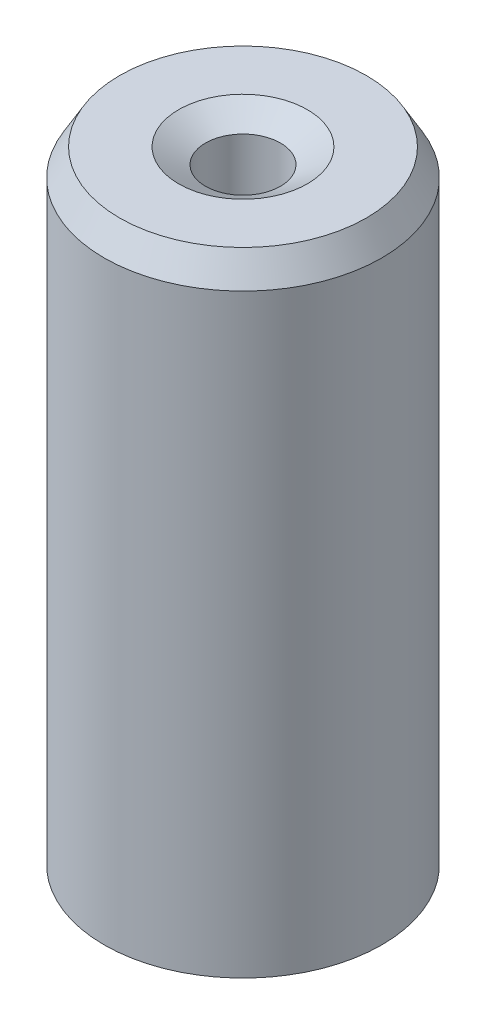
ISO-10303-21;
HEADER;
FILE_DESCRIPTION(('STEP AP214'),'2;1');
FILE_NAME('part.step','',(''),(''),'','','');
FILE_SCHEMA(('AUTOMOTIVE_DESIGN { 1 0 10303 214 1 1 1 1 }'));
ENDSEC;
DATA;
#1=APPLICATION_CONTEXT('core data for automotive mechanical design processes');
#2=APPLICATION_PROTOCOL_DEFINITION('international standard','automotive_design',2000,#1);
#3=PRODUCT_CONTEXT('',#1,'mechanical');
#4=PRODUCT('Part','Part','',(#3));
#5=PRODUCT_RELATED_PRODUCT_CATEGORY('part','',(#4));
#6=PRODUCT_DEFINITION_FORMATION('','',#4);
#7=PRODUCT_DEFINITION_CONTEXT('part definition',#1,'design');
#8=PRODUCT_DEFINITION('design','',#6,#7);
#9=PRODUCT_DEFINITION_SHAPE('','',#8);
#10=(LENGTH_UNIT() NAMED_UNIT(*) SI_UNIT(.MILLI.,.METRE.));
#11=(NAMED_UNIT(*) PLANE_ANGLE_UNIT() SI_UNIT($,.RADIAN.));
#12=(NAMED_UNIT(*) SI_UNIT($,.STERADIAN.) SOLID_ANGLE_UNIT());
#13=UNCERTAINTY_MEASURE_WITH_UNIT(LENGTH_MEASURE(1.E-05),#10,'distance_accuracy_value','');
#14=(GEOMETRIC_REPRESENTATION_CONTEXT(3) GLOBAL_UNCERTAINTY_ASSIGNED_CONTEXT((#13)) GLOBAL_UNIT_ASSIGNED_CONTEXT((#10,
#11,#12)) REPRESENTATION_CONTEXT('',''));
#15=CARTESIAN_POINT('',(0.,0.,0.));
#16=DIRECTION('',(0.,0.,1.));
#17=DIRECTION('',(1.,0.,0.));
#18=AXIS2_PLACEMENT_3D('',#15,#16,#17);
#19=CARTESIAN_POINT('',(0.,22.9424831947394,0.));
#20=DIRECTION('',(0.,-1.,0.));
#21=DIRECTION('',(0.,0.,-1.));
#22=AXIS2_PLACEMENT_3D('',#19,#20,#21);
#23=CYLINDRICAL_SURFACE('',#22,5.);
#24=CARTESIAN_POINT('',(0.,0.557772015662986,0.));
#25=DIRECTION('',(0.,1.,0.));
#26=DIRECTION('',(0.,0.,1.));
#27=AXIS2_PLACEMENT_3D('',#24,#25,#26);
#28=CIRCLE('',#27,5.);
#29=CARTESIAN_POINT('',(0.,0.557772015662986,5.));
#30=VERTEX_POINT('',#29);
#31=EDGE_CURVE('E10',#30,#30,#28,.T.);
#32=ORIENTED_EDGE('',*,*,#31,.T.);
#33=EDGE_LOOP('',(#32));
#34=FACE_BOUND('',#33,.T.);
#35=CARTESIAN_POINT('',(0.,21.976393724571,0.));
#36=DIRECTION('',(0.,1.,0.));
#37=DIRECTION('',(0.,0.,1.));
#38=AXIS2_PLACEMENT_3D('',#35,#36,#37);
#39=CIRCLE('',#38,5.);
#40=CARTESIAN_POINT('',(0.,21.976393724571,5.));
#41=VERTEX_POINT('',#40);
#42=EDGE_CURVE('E50',#41,#41,#39,.F.);
#43=ORIENTED_EDGE('',*,*,#42,.T.);
#44=EDGE_LOOP('',(#43));
#45=FACE_BOUND('',#44,.T.);
#46=ADVANCED_FACE('F39',(#34,#45),#23,.T.);
#47=CARTESIAN_POINT('',(0.,22.9424831947394,0.));
#48=DIRECTION('',(0.,1.,0.));
#49=DIRECTION('',(0.,0.,1.));
#50=AXIS2_PLACEMENT_3D('',#47,#48,#49);
#51=PLANE('',#50);
#52=CARTESIAN_POINT('',(0.,22.9424831947394,0.));
#53=DIRECTION('',(0.,1.,0.));
#54=DIRECTION('',(0.,0.,1.));
#55=AXIS2_PLACEMENT_3D('',#52,#53,#54);
#56=CIRCLE('',#55,2.31601998530468);
#57=CARTESIAN_POINT('',(0.,22.9424831947394,2.31601998530468));
#58=VERTEX_POINT('',#57);
#59=EDGE_CURVE('E58',#58,#58,#56,.F.);
#60=ORIENTED_EDGE('',*,*,#59,.T.);
#61=EDGE_LOOP('',(#60));
#62=FACE_BOUND('',#61,.T.);
#63=CARTESIAN_POINT('',(0.,22.9424831947394,0.));
#64=DIRECTION('',(0.,1.,0.));
#65=DIRECTION('',(0.,0.,1.));
#66=AXIS2_PLACEMENT_3D('',#63,#64,#65);
#67=CIRCLE('',#66,4.44222798433701);
#68=CARTESIAN_POINT('',(0.,22.9424831947394,4.44222798433701));
#69=VERTEX_POINT('',#68);
#70=EDGE_CURVE('E61',#69,#69,#67,.T.);
#71=ORIENTED_EDGE('',*,*,#70,.T.);
#72=EDGE_LOOP('',(#71));
#73=FACE_BOUND('',#72,.T.);
#74=ADVANCED_FACE('F88',(#62,#73),#51,.T.);
#75=CARTESIAN_POINT('',(0.,0.,0.));
#76=DIRECTION('',(0.,1.,0.));
#77=DIRECTION('',(0.,0.,1.));
#78=AXIS2_PLACEMENT_3D('',#75,#76,#77);
#79=PLANE('',#78);
#80=CARTESIAN_POINT('',(0.,0.,0.));
#81=DIRECTION('',(0.,1.,0.));
#82=DIRECTION('',(0.,0.,1.));
#83=AXIS2_PLACEMENT_3D('',#80,#81,#82);
#84=CIRCLE('',#83,1.90770253079926);
#85=CARTESIAN_POINT('',(0.,0.,1.90770253079926));
#86=VERTEX_POINT('',#85);
#87=EDGE_CURVE('E51',#86,#86,#84,.T.);
#88=ORIENTED_EDGE('',*,*,#87,.T.);
#89=EDGE_LOOP('',(#88));
#90=FACE_BOUND('',#89,.T.);
#91=CARTESIAN_POINT('',(0.,0.,0.));
#92=DIRECTION('',(0.,1.,0.));
#93=DIRECTION('',(0.,0.,1.));
#94=AXIS2_PLACEMENT_3D('',#91,#92,#93);
#95=CIRCLE('',#94,4.0339105298316);
#96=CARTESIAN_POINT('',(0.,0.,4.0339105298316));
#97=VERTEX_POINT('',#96);
#98=EDGE_CURVE('E54',#97,#97,#95,.F.);
#99=ORIENTED_EDGE('',*,*,#98,.T.);
#100=EDGE_LOOP('',(#99));
#101=FACE_BOUND('',#100,.T.);
#102=ADVANCED_FACE('F83',(#90,#101),#79,.F.);
#103=CARTESIAN_POINT('',(0.,22.9424831947394,0.));
#104=DIRECTION('',(0.,-1.,0.));
#105=DIRECTION('',(0.,0.,-1.));
#106=AXIS2_PLACEMENT_3D('',#103,#104,#105);
#107=CYLINDRICAL_SURFACE('',#106,1.34993051513628);
#108=CARTESIAN_POINT('',(0.,22.3847111790764,0.));
#109=DIRECTION('',(0.,1.,0.));
#110=DIRECTION('',(0.,0.,1.));
#111=AXIS2_PLACEMENT_3D('',#108,#109,#110);
#112=CIRCLE('',#111,1.34993051513628);
#113=CARTESIAN_POINT('',(0.,22.3847111790764,1.34993051513628));
#114=VERTEX_POINT('',#113);
#115=EDGE_CURVE('E67',#114,#114,#112,.T.);
#116=ORIENTED_EDGE('',*,*,#115,.T.);
#117=EDGE_LOOP('',(#116));
#118=FACE_BOUND('',#117,.T.);
#119=CARTESIAN_POINT('',(0.,0.966089470168394,0.));
#120=DIRECTION('',(0.,1.,0.));
#121=DIRECTION('',(0.,0.,1.));
#122=AXIS2_PLACEMENT_3D('',#119,#120,#121);
#123=CIRCLE('',#122,1.34993051513628);
#124=CARTESIAN_POINT('',(0.,0.966089470168394,1.34993051513628));
#125=VERTEX_POINT('',#124);
#126=EDGE_CURVE('E69',#125,#125,#123,.F.);
#127=ORIENTED_EDGE('',*,*,#126,.T.);
#128=EDGE_LOOP('',(#127));
#129=FACE_BOUND('',#128,.T.);
#130=ADVANCED_FACE('F71',(#118,#129),#107,.F.);
#131=CARTESIAN_POINT('',(0.,22.3847111790764,0.));
#132=DIRECTION('',(0.,1.,0.));
#133=DIRECTION('',(0.,0.,1.));
#134=AXIS2_PLACEMENT_3D('',#131,#132,#133);
#135=CONICAL_SURFACE('',#134,1.34993051513628,1.0471975511966);
#136=ORIENTED_EDGE('',*,*,#59,.F.);
#137=EDGE_LOOP('',(#136));
#138=FACE_BOUND('',#137,.T.);
#139=ORIENTED_EDGE('',*,*,#115,.F.);
#140=EDGE_LOOP('',(#139));
#141=FACE_BOUND('',#140,.T.);
#142=ADVANCED_FACE('F77',(#138,#141),#135,.F.);
#143=CARTESIAN_POINT('',(0.,0.,0.));
#144=DIRECTION('',(0.,-1.,0.));
#145=DIRECTION('',(0.,0.,-1.));
#146=AXIS2_PLACEMENT_3D('',#143,#144,#145);
#147=CONICAL_SURFACE('',#146,1.90770253079926,0.523598775598295);
#148=ORIENTED_EDGE('',*,*,#126,.F.);
#149=EDGE_LOOP('',(#148));
#150=FACE_BOUND('',#149,.T.);
#151=ORIENTED_EDGE('',*,*,#87,.F.);
#152=EDGE_LOOP('',(#151));
#153=FACE_BOUND('',#152,.T.);
#154=ADVANCED_FACE('F73',(#150,#153),#147,.F.);
#155=CARTESIAN_POINT('',(0.,0.557772015662986,0.));
#156=DIRECTION('',(0.,1.,0.));
#157=DIRECTION('',(0.,0.,1.));
#158=AXIS2_PLACEMENT_3D('',#155,#156,#157);
#159=CONICAL_SURFACE('',#158,5.,1.0471975511966);
#160=ORIENTED_EDGE('',*,*,#98,.F.);
#161=EDGE_LOOP('',(#160));
#162=FACE_BOUND('',#161,.T.);
#163=ORIENTED_EDGE('',*,*,#31,.F.);
#164=EDGE_LOOP('',(#163));
#165=FACE_BOUND('',#164,.T.);
#166=ADVANCED_FACE('F76',(#162,#165),#159,.T.);
#167=CARTESIAN_POINT('',(0.,22.9424831947394,0.));
#168=DIRECTION('',(0.,-1.,0.));
#169=DIRECTION('',(0.,0.,-1.));
#170=AXIS2_PLACEMENT_3D('',#167,#168,#169);
#171=CONICAL_SURFACE('',#170,4.44222798433701,0.523598775598296);
#172=ORIENTED_EDGE('',*,*,#42,.F.);
#173=EDGE_LOOP('',(#172));
#174=FACE_BOUND('',#173,.T.);
#175=ORIENTED_EDGE('',*,*,#70,.F.);
#176=EDGE_LOOP('',(#175));
#177=FACE_BOUND('',#176,.T.);
#178=ADVANCED_FACE('F45',(#174,#177),#171,.T.);
#179=CLOSED_SHELL('',(#46,#74,#102,#130,#142,#154,#166,#178));
#180=MANIFOLD_SOLID_BREP('B2',#179);
#181=ADVANCED_BREP_SHAPE_REPRESENTATION('',(#18,#180),#14);
#182=SHAPE_DEFINITION_REPRESENTATION(#9,#181);
ENDSEC;
END-ISO-10303-21;
